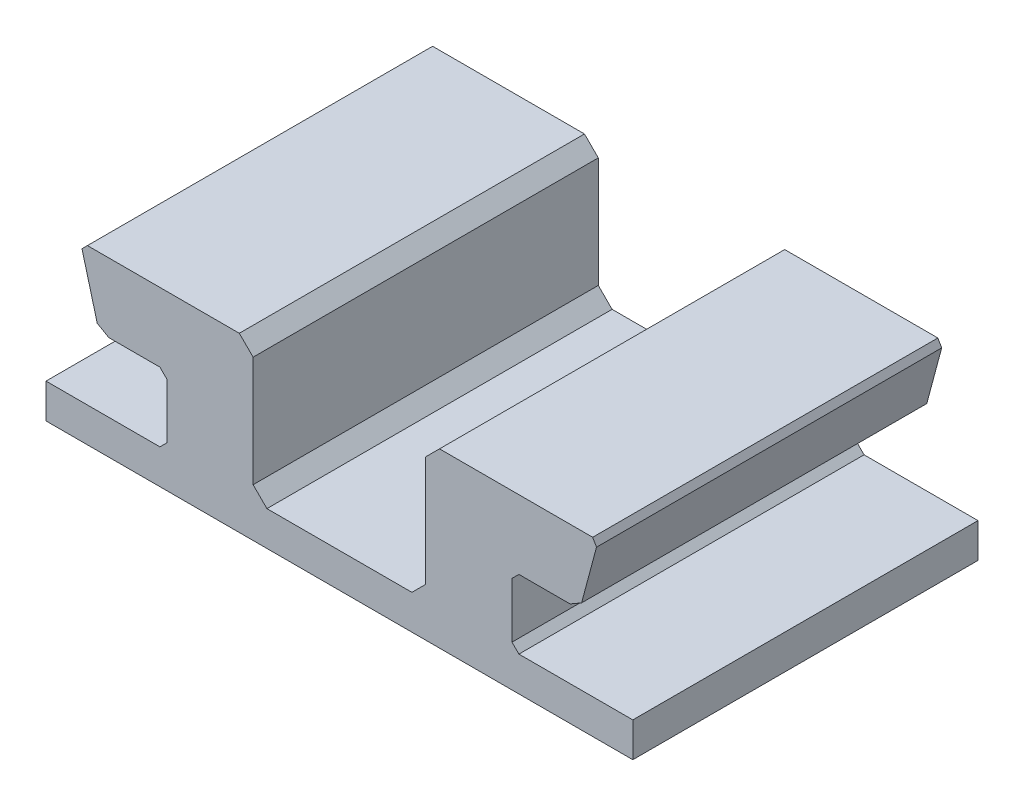
ISO-10303-21;
HEADER;
FILE_DESCRIPTION(('STEP AP214'),'2;1');
FILE_NAME('part.step','',(''),(''),'','','');
FILE_SCHEMA(('AUTOMOTIVE_DESIGN { 1 0 10303 214 1 1 1 1 }'));
ENDSEC;
DATA;
#1=APPLICATION_CONTEXT('core data for automotive mechanical design processes');
#2=APPLICATION_PROTOCOL_DEFINITION('international standard','automotive_design',2000,#1);
#3=PRODUCT_CONTEXT('',#1,'mechanical');
#4=PRODUCT('Part','Part','',(#3));
#5=PRODUCT_RELATED_PRODUCT_CATEGORY('part','',(#4));
#6=PRODUCT_DEFINITION_FORMATION('','',#4);
#7=PRODUCT_DEFINITION_CONTEXT('part definition',#1,'design');
#8=PRODUCT_DEFINITION('design','',#6,#7);
#9=PRODUCT_DEFINITION_SHAPE('','',#8);
#10=(LENGTH_UNIT() NAMED_UNIT(*) SI_UNIT(.MILLI.,.METRE.));
#11=(NAMED_UNIT(*) PLANE_ANGLE_UNIT() SI_UNIT($,.RADIAN.));
#12=(NAMED_UNIT(*) SI_UNIT($,.STERADIAN.) SOLID_ANGLE_UNIT());
#13=UNCERTAINTY_MEASURE_WITH_UNIT(LENGTH_MEASURE(1.E-05),#10,'distance_accuracy_value','');
#14=(GEOMETRIC_REPRESENTATION_CONTEXT(3) GLOBAL_UNCERTAINTY_ASSIGNED_CONTEXT((#13)) GLOBAL_UNIT_ASSIGNED_CONTEXT((#10,
#11,#12)) REPRESENTATION_CONTEXT('',''));
#15=CARTESIAN_POINT('',(0.,0.,0.));
#16=DIRECTION('',(0.,0.,1.));
#17=DIRECTION('',(1.,0.,0.));
#18=AXIS2_PLACEMENT_3D('',#15,#16,#17);
#19=CARTESIAN_POINT('',(50.,20.,50.));
#20=DIRECTION('',(1.,0.,0.));
#21=DIRECTION('',(0.,0.,-1.));
#22=AXIS2_PLACEMENT_3D('',#19,#20,#21);
#23=PLANE('',#22);
#24=DIRECTION('',(0.,-1.,0.));
#25=VECTOR('',#24,1.);
#26=CARTESIAN_POINT('',(50.,20.,50.));
#27=LINE('',#26,#25);
#28=CARTESIAN_POINT('',(50.,18.,50.));
#29=VERTEX_POINT('',#28);
#30=CARTESIAN_POINT('',(50.,1.99999999999999,50.));
#31=VERTEX_POINT('',#30);
#32=EDGE_CURVE('E302',#29,#31,#27,.T.);
#33=ORIENTED_EDGE('',*,*,#32,.F.);
#34=DIRECTION('',(0.,0.,-1.));
#35=VECTOR('',#34,1.);
#36=CARTESIAN_POINT('',(50.,18.,50.));
#37=LINE('',#36,#35);
#38=CARTESIAN_POINT('',(50.,18.,0.));
#39=VERTEX_POINT('',#38);
#40=EDGE_CURVE('E321',#29,#39,#37,.T.);
#41=ORIENTED_EDGE('',*,*,#40,.T.);
#42=DIRECTION('',(0.,-1.,0.));
#43=VECTOR('',#42,1.);
#44=CARTESIAN_POINT('',(50.,20.,0.));
#45=LINE('',#44,#43);
#46=CARTESIAN_POINT('',(50.,1.99999999999999,0.));
#47=VERTEX_POINT('',#46);
#48=EDGE_CURVE('E266',#39,#47,#45,.T.);
#49=ORIENTED_EDGE('',*,*,#48,.T.);
#50=DIRECTION('',(0.,0.,1.));
#51=VECTOR('',#50,1.);
#52=CARTESIAN_POINT('',(50.,1.99999999999999,50.));
#53=LINE('',#52,#51);
#54=EDGE_CURVE('E319',#47,#31,#53,.T.);
#55=ORIENTED_EDGE('',*,*,#54,.T.);
#56=EDGE_LOOP('',(#33,#41,#49,#55));
#57=FACE_BOUND('',#56,.T.);
#58=ADVANCED_FACE('F35',(#57),#23,.F.);
#59=CARTESIAN_POINT('',(25.,0.,50.));
#60=DIRECTION('',(0.,-1.,0.));
#61=DIRECTION('',(0.,0.,-1.));
#62=AXIS2_PLACEMENT_3D('',#59,#60,#61);
#63=PLANE('',#62);
#64=DIRECTION('',(-1.,0.,0.));
#65=VECTOR('',#64,1.);
#66=CARTESIAN_POINT('',(25.,0.,50.));
#67=LINE('',#66,#65);
#68=CARTESIAN_POINT('',(48.,0.,50.));
#69=VERTEX_POINT('',#68);
#70=CARTESIAN_POINT('',(27.,0.,50.));
#71=VERTEX_POINT('',#70);
#72=EDGE_CURVE('E447',#69,#71,#67,.T.);
#73=ORIENTED_EDGE('',*,*,#72,.F.);
#74=DIRECTION('',(0.,0.,-1.));
#75=VECTOR('',#74,1.);
#76=CARTESIAN_POINT('',(48.,0.,0.));
#77=LINE('',#76,#75);
#78=CARTESIAN_POINT('',(48.,0.,0.));
#79=VERTEX_POINT('',#78);
#80=EDGE_CURVE('E346',#69,#79,#77,.T.);
#81=ORIENTED_EDGE('',*,*,#80,.T.);
#82=DIRECTION('',(-1.,0.,0.));
#83=VECTOR('',#82,1.);
#84=CARTESIAN_POINT('',(25.,0.,0.));
#85=LINE('',#84,#83);
#86=CARTESIAN_POINT('',(27.,0.,0.));
#87=VERTEX_POINT('',#86);
#88=EDGE_CURVE('E269',#79,#87,#85,.T.);
#89=ORIENTED_EDGE('',*,*,#88,.T.);
#90=DIRECTION('',(0.,0.,1.));
#91=VECTOR('',#90,1.);
#92=CARTESIAN_POINT('',(27.,0.,50.));
#93=LINE('',#92,#91);
#94=EDGE_CURVE('E344',#87,#71,#93,.T.);
#95=ORIENTED_EDGE('',*,*,#94,.T.);
#96=EDGE_LOOP('',(#73,#81,#89,#95));
#97=FACE_BOUND('',#96,.T.);
#98=ADVANCED_FACE('F463',(#97),#63,.F.);
#99=CARTESIAN_POINT('',(25.,20.,50.));
#100=DIRECTION('',(-1.,0.,0.));
#101=DIRECTION('',(0.,0.,1.));
#102=AXIS2_PLACEMENT_3D('',#99,#100,#101);
#103=PLANE('',#102);
#104=DIRECTION('',(0.,1.,0.));
#105=VECTOR('',#104,1.);
#106=CARTESIAN_POINT('',(25.,20.,0.));
#107=LINE('',#106,#105);
#108=CARTESIAN_POINT('',(25.,2.00000000000002,0.));
#109=VERTEX_POINT('',#108);
#110=CARTESIAN_POINT('',(25.,18.,0.));
#111=VERTEX_POINT('',#110);
#112=EDGE_CURVE('E272',#109,#111,#107,.T.);
#113=ORIENTED_EDGE('',*,*,#112,.T.);
#114=DIRECTION('',(0.,0.,1.));
#115=VECTOR('',#114,1.);
#116=CARTESIAN_POINT('',(25.,18.,50.));
#117=LINE('',#116,#115);
#118=CARTESIAN_POINT('',(25.,18.,50.));
#119=VERTEX_POINT('',#118);
#120=EDGE_CURVE('E342',#111,#119,#117,.T.);
#121=ORIENTED_EDGE('',*,*,#120,.T.);
#122=DIRECTION('',(0.,1.,0.));
#123=VECTOR('',#122,1.);
#124=CARTESIAN_POINT('',(25.,20.,50.));
#125=LINE('',#124,#123);
#126=CARTESIAN_POINT('',(25.,2.00000000000002,50.));
#127=VERTEX_POINT('',#126);
#128=EDGE_CURVE('E444',#127,#119,#125,.T.);
#129=ORIENTED_EDGE('',*,*,#128,.F.);
#130=DIRECTION('',(0.,0.,-1.));
#131=VECTOR('',#130,1.);
#132=CARTESIAN_POINT('',(25.,2.00000000000002,0.));
#133=LINE('',#132,#131);
#134=EDGE_CURVE('E339',#127,#109,#133,.T.);
#135=ORIENTED_EDGE('',*,*,#134,.T.);
#136=EDGE_LOOP('',(#113,#121,#129,#135));
#137=FACE_BOUND('',#136,.T.);
#138=ADVANCED_FACE('F473',(#137),#103,.F.);
#139=CARTESIAN_POINT('',(0.,20.,50.));
#140=DIRECTION('',(0.,-1.,0.));
#141=DIRECTION('',(0.,0.,-1.));
#142=AXIS2_PLACEMENT_3D('',#139,#140,#141);
#143=PLANE('',#142);
#144=DIRECTION('',(-1.,0.,0.));
#145=VECTOR('',#144,1.);
#146=CARTESIAN_POINT('',(0.,20.,0.));
#147=LINE('',#146,#145);
#148=CARTESIAN_POINT('',(23.,20.,0.));
#149=VERTEX_POINT('',#148);
#150=CARTESIAN_POINT('',(1.00000000000003,20.,0.));
#151=VERTEX_POINT('',#150);
#152=EDGE_CURVE('E275',#149,#151,#147,.T.);
#153=ORIENTED_EDGE('',*,*,#152,.T.);
#154=DIRECTION('',(0.,0.,1.));
#155=VECTOR('',#154,1.);
#156=CARTESIAN_POINT('',(1.00000000000003,20.,50.));
#157=LINE('',#156,#155);
#158=CARTESIAN_POINT('',(1.00000000000003,20.,50.));
#159=VERTEX_POINT('',#158);
#160=EDGE_CURVE('E408',#151,#159,#157,.T.);
#161=ORIENTED_EDGE('',*,*,#160,.T.);
#162=DIRECTION('',(-1.,0.,0.));
#163=VECTOR('',#162,1.);
#164=CARTESIAN_POINT('',(0.,20.,50.));
#165=LINE('',#164,#163);
#166=CARTESIAN_POINT('',(23.,20.,50.));
#167=VERTEX_POINT('',#166);
#168=EDGE_CURVE('E439',#167,#159,#165,.T.);
#169=ORIENTED_EDGE('',*,*,#168,.F.);
#170=DIRECTION('',(0.,0.,-1.));
#171=VECTOR('',#170,1.);
#172=CARTESIAN_POINT('',(23.,20.,50.));
#173=LINE('',#172,#171);
#174=EDGE_CURVE('E336',#167,#149,#173,.T.);
#175=ORIENTED_EDGE('',*,*,#174,.T.);
#176=EDGE_LOOP('',(#153,#161,#169,#175));
#177=FACE_BOUND('',#176,.T.);
#178=ADVANCED_FACE('F482',(#177),#143,.F.);
#179=CARTESIAN_POINT('',(0.,10.,50.));
#180=DIRECTION('',(0.,1.,0.));
#181=DIRECTION('',(0.,0.,1.));
#182=AXIS2_PLACEMENT_3D('',#179,#180,#181);
#183=PLANE('',#182);
#184=DIRECTION('',(1.,0.,0.));
#185=VECTOR('',#184,1.);
#186=CARTESIAN_POINT('',(0.,10.,0.));
#187=LINE('',#186,#185);
#188=CARTESIAN_POINT('',(4.09370548668432,10.,0.));
#189=VERTEX_POINT('',#188);
#190=CARTESIAN_POINT('',(11.5,10.,0.));
#191=VERTEX_POINT('',#190);
#192=EDGE_CURVE('E278',#189,#191,#187,.T.);
#193=ORIENTED_EDGE('',*,*,#192,.T.);
#194=DIRECTION('',(0.,0.,1.));
#195=VECTOR('',#194,1.);
#196=CARTESIAN_POINT('',(11.5,10.,50.));
#197=LINE('',#196,#195);
#198=CARTESIAN_POINT('',(11.5,10.,50.));
#199=VERTEX_POINT('',#198);
#200=EDGE_CURVE('E401',#191,#199,#197,.T.);
#201=ORIENTED_EDGE('',*,*,#200,.T.);
#202=DIRECTION('',(1.,0.,0.));
#203=VECTOR('',#202,1.);
#204=CARTESIAN_POINT('',(0.,10.,50.));
#205=LINE('',#204,#203);
#206=CARTESIAN_POINT('',(4.09370548668432,10.,50.));
#207=VERTEX_POINT('',#206);
#208=EDGE_CURVE('E435',#207,#199,#205,.T.);
#209=ORIENTED_EDGE('',*,*,#208,.F.);
#210=DIRECTION('',(0.,0.,-1.));
#211=VECTOR('',#210,1.);
#212=CARTESIAN_POINT('',(4.09370548668432,10.,0.));
#213=LINE('',#212,#211);
#214=EDGE_CURVE('E398',#207,#189,#213,.T.);
#215=ORIENTED_EDGE('',*,*,#214,.T.);
#216=EDGE_LOOP('',(#193,#201,#209,#215));
#217=FACE_BOUND('',#216,.T.);
#218=ADVANCED_FACE('F428',(#217),#183,.F.);
#219=CARTESIAN_POINT('',(12.5,0.,50.));
#220=DIRECTION('',(1.,0.,0.));
#221=DIRECTION('',(0.,0.,-1.));
#222=AXIS2_PLACEMENT_3D('',#219,#220,#221);
#223=PLANE('',#222);
#224=DIRECTION('',(0.,-1.,0.));
#225=VECTOR('',#224,1.);
#226=CARTESIAN_POINT('',(12.5,0.,0.));
#227=LINE('',#226,#225);
#228=CARTESIAN_POINT('',(12.5,9.,0.));
#229=VERTEX_POINT('',#228);
#230=CARTESIAN_POINT('',(12.5,1.,0.));
#231=VERTEX_POINT('',#230);
#232=EDGE_CURVE('E281',#229,#231,#227,.T.);
#233=ORIENTED_EDGE('',*,*,#232,.T.);
#234=DIRECTION('',(0.,0.,1.));
#235=VECTOR('',#234,1.);
#236=CARTESIAN_POINT('',(12.5,1.,50.));
#237=LINE('',#236,#235);
#238=CARTESIAN_POINT('',(12.5,1.,50.));
#239=VERTEX_POINT('',#238);
#240=EDGE_CURVE('E396',#231,#239,#237,.T.);
#241=ORIENTED_EDGE('',*,*,#240,.T.);
#242=DIRECTION('',(0.,-1.,0.));
#243=VECTOR('',#242,1.);
#244=CARTESIAN_POINT('',(12.5,0.,50.));
#245=LINE('',#244,#243);
#246=CARTESIAN_POINT('',(12.5,9.,50.));
#247=VERTEX_POINT('',#246);
#248=EDGE_CURVE('E234',#247,#239,#245,.T.);
#249=ORIENTED_EDGE('',*,*,#248,.F.);
#250=DIRECTION('',(0.,0.,-1.));
#251=VECTOR('',#250,1.);
#252=CARTESIAN_POINT('',(12.5,9.,0.));
#253=LINE('',#252,#251);
#254=EDGE_CURVE('E393',#247,#229,#253,.T.);
#255=ORIENTED_EDGE('',*,*,#254,.T.);
#256=EDGE_LOOP('',(#233,#241,#249,#255));
#257=FACE_BOUND('',#256,.T.);
#258=ADVANCED_FACE('F437',(#257),#223,.F.);
#259=CARTESIAN_POINT('',(-5.,0.,50.));
#260=DIRECTION('',(0.,-1.,0.));
#261=DIRECTION('',(0.,0.,-1.));
#262=AXIS2_PLACEMENT_3D('',#259,#260,#261);
#263=PLANE('',#262);
#264=DIRECTION('',(-1.,0.,0.));
#265=VECTOR('',#264,1.);
#266=CARTESIAN_POINT('',(-5.,0.,50.));
#267=LINE('',#266,#265);
#268=CARTESIAN_POINT('',(11.5,0.,50.));
#269=VERTEX_POINT('',#268);
#270=CARTESIAN_POINT('',(-5.,0.,50.));
#271=VERTEX_POINT('',#270);
#272=EDGE_CURVE('E221',#269,#271,#267,.T.);
#273=ORIENTED_EDGE('',*,*,#272,.F.);
#274=DIRECTION('',(0.,0.,-1.));
#275=VECTOR('',#274,1.);
#276=CARTESIAN_POINT('',(11.5,0.,0.));
#277=LINE('',#276,#275);
#278=CARTESIAN_POINT('',(11.5,0.,0.));
#279=VERTEX_POINT('',#278);
#280=EDGE_CURVE('E391',#269,#279,#277,.T.);
#281=ORIENTED_EDGE('',*,*,#280,.T.);
#282=DIRECTION('',(-1.,0.,0.));
#283=VECTOR('',#282,1.);
#284=CARTESIAN_POINT('',(-5.,0.,0.));
#285=LINE('',#284,#283);
#286=CARTESIAN_POINT('',(-5.,0.,0.));
#287=VERTEX_POINT('',#286);
#288=EDGE_CURVE('E240',#279,#287,#285,.T.);
#289=ORIENTED_EDGE('',*,*,#288,.T.);
#290=DIRECTION('',(0.,0.,-1.));
#291=VECTOR('',#290,1.);
#292=CARTESIAN_POINT('',(-5.,0.,50.));
#293=LINE('',#292,#291);
#294=EDGE_CURVE('E237',#271,#287,#293,.T.);
#295=ORIENTED_EDGE('',*,*,#294,.F.);
#296=EDGE_LOOP('',(#273,#281,#289,#295));
#297=FACE_BOUND('',#296,.T.);
#298=ADVANCED_FACE('F238',(#297),#263,.F.);
#299=CARTESIAN_POINT('',(-5.,-5.,50.));
#300=DIRECTION('',(1.,0.,0.));
#301=DIRECTION('',(0.,0.,-1.));
#302=AXIS2_PLACEMENT_3D('',#299,#300,#301);
#303=PLANE('',#302);
#304=DIRECTION('',(0.,-1.,0.));
#305=VECTOR('',#304,1.);
#306=CARTESIAN_POINT('',(-5.,-5.,0.));
#307=LINE('',#306,#305);
#308=CARTESIAN_POINT('',(-5.,-5.,0.));
#309=VERTEX_POINT('',#308);
#310=EDGE_CURVE('E285',#287,#309,#307,.T.);
#311=ORIENTED_EDGE('',*,*,#310,.T.);
#312=DIRECTION('',(0.,0.,-1.));
#313=VECTOR('',#312,1.);
#314=CARTESIAN_POINT('',(-5.,-5.,50.));
#315=LINE('',#314,#313);
#316=CARTESIAN_POINT('',(-5.,-5.,50.));
#317=VERTEX_POINT('',#316);
#318=EDGE_CURVE('E244',#317,#309,#315,.T.);
#319=ORIENTED_EDGE('',*,*,#318,.F.);
#320=DIRECTION('',(0.,-1.,0.));
#321=VECTOR('',#320,1.);
#322=CARTESIAN_POINT('',(-5.,-5.,50.));
#323=LINE('',#322,#321);
#324=EDGE_CURVE('E226',#271,#317,#323,.T.);
#325=ORIENTED_EDGE('',*,*,#324,.F.);
#326=ORIENTED_EDGE('',*,*,#294,.T.);
#327=EDGE_LOOP('',(#311,#319,#325,#326));
#328=FACE_BOUND('',#327,.T.);
#329=ADVANCED_FACE('F246',(#328),#303,.F.);
#330=CARTESIAN_POINT('',(-5.,-5.,50.));
#331=DIRECTION('',(0.,1.,0.));
#332=DIRECTION('',(-1.,0.,0.));
#333=AXIS2_PLACEMENT_3D('',#330,#331,#332);
#334=PLANE('',#333);
#335=DIRECTION('',(1.,0.,0.));
#336=VECTOR('',#335,1.);
#337=CARTESIAN_POINT('',(-5.,-5.,0.));
#338=LINE('',#337,#336);
#339=CARTESIAN_POINT('',(80.,-4.99999999999998,0.));
#340=VERTEX_POINT('',#339);
#341=EDGE_CURVE('E287',#309,#340,#338,.T.);
#342=ORIENTED_EDGE('',*,*,#341,.T.);
#343=DIRECTION('',(0.,0.,-1.));
#344=VECTOR('',#343,1.);
#345=CARTESIAN_POINT('',(80.,-4.99999999999998,50.));
#346=LINE('',#345,#344);
#347=CARTESIAN_POINT('',(80.,-4.99999999999998,50.));
#348=VERTEX_POINT('',#347);
#349=EDGE_CURVE('E305',#348,#340,#346,.T.);
#350=ORIENTED_EDGE('',*,*,#349,.F.);
#351=DIRECTION('',(1.,0.,0.));
#352=VECTOR('',#351,1.);
#353=CARTESIAN_POINT('',(-5.,-5.,50.));
#354=LINE('',#353,#352);
#355=EDGE_CURVE('E249',#317,#348,#354,.T.);
#356=ORIENTED_EDGE('',*,*,#355,.F.);
#357=ORIENTED_EDGE('',*,*,#318,.T.);
#358=EDGE_LOOP('',(#342,#350,#356,#357));
#359=FACE_BOUND('',#358,.T.);
#360=ADVANCED_FACE('F589',(#359),#334,.F.);
#361=CARTESIAN_POINT('',(80.,-4.99999999999998,50.));
#362=DIRECTION('',(-1.,0.,0.));
#363=DIRECTION('',(0.,0.,1.));
#364=AXIS2_PLACEMENT_3D('',#361,#362,#363);
#365=PLANE('',#364);
#366=DIRECTION('',(0.,1.,0.));
#367=VECTOR('',#366,1.);
#368=CARTESIAN_POINT('',(80.,-4.99999999999998,0.));
#369=LINE('',#368,#367);
#370=CARTESIAN_POINT('',(80.,0.,0.));
#371=VERTEX_POINT('',#370);
#372=EDGE_CURVE('E289',#340,#371,#369,.T.);
#373=ORIENTED_EDGE('',*,*,#372,.T.);
#374=DIRECTION('',(0.,0.,-1.));
#375=VECTOR('',#374,1.);
#376=CARTESIAN_POINT('',(80.,0.,50.));
#377=LINE('',#376,#375);
#378=CARTESIAN_POINT('',(80.,0.,50.));
#379=VERTEX_POINT('',#378);
#380=EDGE_CURVE('E265',#379,#371,#377,.T.);
#381=ORIENTED_EDGE('',*,*,#380,.F.);
#382=DIRECTION('',(0.,1.,0.));
#383=VECTOR('',#382,1.);
#384=CARTESIAN_POINT('',(80.,-4.99999999999998,50.));
#385=LINE('',#384,#383);
#386=EDGE_CURVE('E251',#348,#379,#385,.T.);
#387=ORIENTED_EDGE('',*,*,#386,.F.);
#388=ORIENTED_EDGE('',*,*,#349,.T.);
#389=EDGE_LOOP('',(#373,#381,#387,#388));
#390=FACE_BOUND('',#389,.T.);
#391=ADVANCED_FACE('F596',(#390),#365,.F.);
#392=CARTESIAN_POINT('',(62.5,0.,50.));
#393=DIRECTION('',(0.,-1.,0.));
#394=DIRECTION('',(0.,0.,-1.));
#395=AXIS2_PLACEMENT_3D('',#392,#393,#394);
#396=PLANE('',#395);
#397=DIRECTION('',(-1.,0.,0.));
#398=VECTOR('',#397,1.);
#399=CARTESIAN_POINT('',(62.5,0.,0.));
#400=LINE('',#399,#398);
#401=CARTESIAN_POINT('',(63.5,0.,0.));
#402=VERTEX_POINT('',#401);
#403=EDGE_CURVE('E291',#371,#402,#400,.T.);
#404=ORIENTED_EDGE('',*,*,#403,.T.);
#405=DIRECTION('',(0.,0.,1.));
#406=VECTOR('',#405,1.);
#407=CARTESIAN_POINT('',(63.5,0.,50.));
#408=LINE('',#407,#406);
#409=CARTESIAN_POINT('',(63.5,0.,50.));
#410=VERTEX_POINT('',#409);
#411=EDGE_CURVE('E389',#402,#410,#408,.T.);
#412=ORIENTED_EDGE('',*,*,#411,.T.);
#413=DIRECTION('',(-1.,0.,0.));
#414=VECTOR('',#413,1.);
#415=CARTESIAN_POINT('',(62.5,0.,50.));
#416=LINE('',#415,#414);
#417=EDGE_CURVE('E256',#379,#410,#416,.T.);
#418=ORIENTED_EDGE('',*,*,#417,.F.);
#419=ORIENTED_EDGE('',*,*,#380,.T.);
#420=EDGE_LOOP('',(#404,#412,#418,#419));
#421=FACE_BOUND('',#420,.T.);
#422=ADVANCED_FACE('F599',(#421),#396,.F.);
#423=CARTESIAN_POINT('',(62.5,10.,50.));
#424=DIRECTION('',(-1.,0.,0.));
#425=DIRECTION('',(0.,0.,1.));
#426=AXIS2_PLACEMENT_3D('',#423,#424,#425);
#427=PLANE('',#426);
#428=DIRECTION('',(0.,1.,0.));
#429=VECTOR('',#428,1.);
#430=CARTESIAN_POINT('',(62.5,10.,0.));
#431=LINE('',#430,#429);
#432=CARTESIAN_POINT('',(62.5,1.00000000000001,0.));
#433=VERTEX_POINT('',#432);
#434=CARTESIAN_POINT('',(62.5,9.00000000000001,0.));
#435=VERTEX_POINT('',#434);
#436=EDGE_CURVE('E294',#433,#435,#431,.T.);
#437=ORIENTED_EDGE('',*,*,#436,.T.);
#438=DIRECTION('',(0.,0.,1.));
#439=VECTOR('',#438,1.);
#440=CARTESIAN_POINT('',(62.5,9.00000000000001,50.));
#441=LINE('',#440,#439);
#442=CARTESIAN_POINT('',(62.5,9.00000000000001,50.));
#443=VERTEX_POINT('',#442);
#444=EDGE_CURVE('E387',#435,#443,#441,.T.);
#445=ORIENTED_EDGE('',*,*,#444,.T.);
#446=DIRECTION('',(0.,1.,0.));
#447=VECTOR('',#446,1.);
#448=CARTESIAN_POINT('',(62.5,10.,50.));
#449=LINE('',#448,#447);
#450=CARTESIAN_POINT('',(62.5,1.00000000000001,50.));
#451=VERTEX_POINT('',#450);
#452=EDGE_CURVE('E259',#451,#443,#449,.T.);
#453=ORIENTED_EDGE('',*,*,#452,.F.);
#454=DIRECTION('',(0.,0.,-1.));
#455=VECTOR('',#454,1.);
#456=CARTESIAN_POINT('',(62.5,1.00000000000001,0.));
#457=LINE('',#456,#455);
#458=EDGE_CURVE('E384',#451,#433,#457,.T.);
#459=ORIENTED_EDGE('',*,*,#458,.T.);
#460=EDGE_LOOP('',(#437,#445,#453,#459));
#461=FACE_BOUND('',#460,.T.);
#462=ADVANCED_FACE('F604',(#461),#427,.F.);
#463=CARTESIAN_POINT('',(62.5,10.,50.));
#464=DIRECTION('',(0.,1.,0.));
#465=DIRECTION('',(0.,0.,1.));
#466=AXIS2_PLACEMENT_3D('',#463,#464,#465);
#467=PLANE('',#466);
#468=DIRECTION('',(1.,0.,0.));
#469=VECTOR('',#468,1.);
#470=CARTESIAN_POINT('',(62.5,10.,0.));
#471=LINE('',#470,#469);
#472=CARTESIAN_POINT('',(63.5,10.,0.));
#473=VERTEX_POINT('',#472);
#474=CARTESIAN_POINT('',(70.9062945133157,10.,0.));
#475=VERTEX_POINT('',#474);
#476=EDGE_CURVE('E297',#473,#475,#471,.T.);
#477=ORIENTED_EDGE('',*,*,#476,.T.);
#478=DIRECTION('',(0.,0.,1.));
#479=VECTOR('',#478,1.);
#480=CARTESIAN_POINT('',(70.9062945133157,10.,50.));
#481=LINE('',#480,#479);
#482=CARTESIAN_POINT('',(70.9062945133157,10.,50.));
#483=VERTEX_POINT('',#482);
#484=EDGE_CURVE('E382',#475,#483,#481,.T.);
#485=ORIENTED_EDGE('',*,*,#484,.T.);
#486=DIRECTION('',(1.,0.,0.));
#487=VECTOR('',#486,1.);
#488=CARTESIAN_POINT('',(62.5,10.,50.));
#489=LINE('',#488,#487);
#490=CARTESIAN_POINT('',(63.5,10.,50.));
#491=VERTEX_POINT('',#490);
#492=EDGE_CURVE('E261',#491,#483,#489,.T.);
#493=ORIENTED_EDGE('',*,*,#492,.F.);
#494=DIRECTION('',(0.,0.,-1.));
#495=VECTOR('',#494,1.);
#496=CARTESIAN_POINT('',(63.5,10.,0.));
#497=LINE('',#496,#495);
#498=EDGE_CURVE('E379',#491,#473,#497,.T.);
#499=ORIENTED_EDGE('',*,*,#498,.T.);
#500=EDGE_LOOP('',(#477,#485,#493,#499));
#501=FACE_BOUND('',#500,.T.);
#502=ADVANCED_FACE('F610',(#501),#467,.F.);
#503=CARTESIAN_POINT('',(50.,20.,50.));
#504=DIRECTION('',(0.,-1.,0.));
#505=DIRECTION('',(1.,0.,0.));
#506=AXIS2_PLACEMENT_3D('',#503,#504,#505);
#507=PLANE('',#506);
#508=DIRECTION('',(-1.,0.,0.));
#509=VECTOR('',#508,1.);
#510=CARTESIAN_POINT('',(50.,20.,50.));
#511=LINE('',#510,#509);
#512=CARTESIAN_POINT('',(74.1835034190723,20.,50.));
#513=VERTEX_POINT('',#512);
#514=CARTESIAN_POINT('',(52.,20.,50.));
#515=VERTEX_POINT('',#514);
#516=EDGE_CURVE('E263',#513,#515,#511,.T.);
#517=ORIENTED_EDGE('',*,*,#516,.F.);
#518=DIRECTION('',(0.,0.,-1.));
#519=VECTOR('',#518,1.);
#520=CARTESIAN_POINT('',(74.1835034190723,20.,0.));
#521=LINE('',#520,#519);
#522=CARTESIAN_POINT('',(74.1835034190723,20.,0.));
#523=VERTEX_POINT('',#522);
#524=EDGE_CURVE('E357',#513,#523,#521,.T.);
#525=ORIENTED_EDGE('',*,*,#524,.T.);
#526=DIRECTION('',(-1.,0.,0.));
#527=VECTOR('',#526,1.);
#528=CARTESIAN_POINT('',(50.,20.,0.));
#529=LINE('',#528,#527);
#530=CARTESIAN_POINT('',(52.,20.,0.));
#531=VERTEX_POINT('',#530);
#532=EDGE_CURVE('E300',#523,#531,#529,.T.);
#533=ORIENTED_EDGE('',*,*,#532,.T.);
#534=DIRECTION('',(0.,0.,1.));
#535=VECTOR('',#534,1.);
#536=CARTESIAN_POINT('',(52.,20.,50.));
#537=LINE('',#536,#535);
#538=EDGE_CURVE('E329',#531,#515,#537,.T.);
#539=ORIENTED_EDGE('',*,*,#538,.T.);
#540=EDGE_LOOP('',(#517,#525,#533,#539));
#541=FACE_BOUND('',#540,.T.);
#542=ADVANCED_FACE('F619',(#541),#507,.F.);
#543=CARTESIAN_POINT('',(0.,0.,50.));
#544=DIRECTION('',(0.,0.,1.));
#545=DIRECTION('',(1.,0.,0.));
#546=AXIS2_PLACEMENT_3D('',#543,#544,#545);
#547=PLANE('',#546);
#548=DIRECTION('',(-0.258819045102518,-0.965925826289069,0.));
#549=VECTOR('',#548,1.);
#550=CARTESIAN_POINT('',(64.9759526419166,-17.4102540378442,50.));
#551=LINE('',#550,#549);
#552=CARTESIAN_POINT('',(72.5793271207913,10.9659258262891,50.));
#553=VERTEX_POINT('',#552);
#554=CARTESIAN_POINT('',(74.7411809548975,19.034074173711,50.));
#555=VERTEX_POINT('',#554);
#556=EDGE_CURVE('E317',#553,#555,#551,.F.);
#557=ORIENTED_EDGE('',*,*,#556,.T.);
#558=DIRECTION('',(0.499999999999994,-0.866025403784442,0.));
#559=VECTOR('',#558,1.);
#560=CARTESIAN_POINT('',(64.297881602149,37.1223992513228,50.));
#561=LINE('',#560,#559);
#562=EDGE_CURVE('E377',#555,#513,#561,.F.);
#563=ORIENTED_EDGE('',*,*,#562,.T.);
#564=ORIENTED_EDGE('',*,*,#516,.T.);
#565=DIRECTION('',(0.70710678118655,0.707106781186545,0.));
#566=VECTOR('',#565,1.);
#567=CARTESIAN_POINT('',(15.9999999999998,-15.9999999999999,50.));
#568=LINE('',#567,#566);
#569=EDGE_CURVE('E334',#515,#29,#568,.F.);
#570=ORIENTED_EDGE('',*,*,#569,.T.);
#571=ORIENTED_EDGE('',*,*,#32,.T.);
#572=DIRECTION('',(0.707106781186552,0.707106781186543,0.));
#573=VECTOR('',#572,1.);
#574=CARTESIAN_POINT('',(48.,0.,50.));
#575=LINE('',#574,#573);
#576=EDGE_CURVE('E351',#31,#69,#575,.F.);
#577=ORIENTED_EDGE('',*,*,#576,.T.);
#578=ORIENTED_EDGE('',*,*,#72,.T.);
#579=DIRECTION('',(0.707106781186543,-0.707106781186552,0.));
#580=VECTOR('',#579,1.);
#581=CARTESIAN_POINT('',(25.,2.00000000000002,50.));
#582=LINE('',#581,#580);
#583=EDGE_CURVE('E355',#71,#127,#582,.F.);
#584=ORIENTED_EDGE('',*,*,#583,.T.);
#585=ORIENTED_EDGE('',*,*,#128,.T.);
#586=DIRECTION('',(0.707106781186545,-0.70710678118655,0.));
#587=VECTOR('',#586,1.);
#588=CARTESIAN_POINT('',(21.5000000000001,21.4999999999999,50.));
#589=LINE('',#588,#587);
#590=EDGE_CURVE('E332',#119,#167,#589,.F.);
#591=ORIENTED_EDGE('',*,*,#590,.T.);
#592=ORIENTED_EDGE('',*,*,#168,.T.);
#593=DIRECTION('',(0.707106781186546,0.707106781186549,0.));
#594=VECTOR('',#593,1.);
#595=CARTESIAN_POINT('',(-9.49999999999998,9.49999999999994,50.));
#596=LINE('',#595,#594);
#597=CARTESIAN_POINT('',(0.211324865405224,19.2113248654052,50.));
#598=VERTEX_POINT('',#597);
#599=EDGE_CURVE('E372',#159,#598,#596,.F.);
#600=ORIENTED_EDGE('',*,*,#599,.T.);
#601=DIRECTION('',(-0.258819045102518,0.965925826289069,0.));
#602=VECTOR('',#601,1.);
#603=CARTESIAN_POINT('',(4.99999999999999,1.33974596215559,50.));
#604=LINE('',#603,#602);
#605=CARTESIAN_POINT('',(2.42067287920872,10.9659258262891,50.));
#606=VERTEX_POINT('',#605);
#607=EDGE_CURVE('E314',#598,#606,#604,.F.);
#608=ORIENTED_EDGE('',*,*,#607,.T.);
#609=DIRECTION('',(-0.866025403784436,0.500000000000004,0.));
#610=VECTOR('',#609,1.);
#611=CARTESIAN_POINT('',(5.35355339059331,9.27262647354015,50.));
#612=LINE('',#611,#610);
#613=EDGE_CURVE('E374',#606,#207,#612,.F.);
#614=ORIENTED_EDGE('',*,*,#613,.T.);
#615=ORIENTED_EDGE('',*,*,#208,.T.);
#616=DIRECTION('',(-0.707106781186543,0.707106781186552,0.));
#617=VECTOR('',#616,1.);
#618=CARTESIAN_POINT('',(12.5,9.,50.));
#619=LINE('',#618,#617);
#620=EDGE_CURVE('E11',#199,#247,#619,.F.);
#621=ORIENTED_EDGE('',*,*,#620,.T.);
#622=ORIENTED_EDGE('',*,*,#248,.T.);
#623=DIRECTION('',(0.707106781186553,0.707106781186542,0.));
#624=VECTOR('',#623,1.);
#625=CARTESIAN_POINT('',(11.5,0.,50.));
#626=LINE('',#625,#624);
#627=EDGE_CURVE('E230',#239,#269,#626,.F.);
#628=ORIENTED_EDGE('',*,*,#627,.T.);
#629=ORIENTED_EDGE('',*,*,#272,.T.);
#630=ORIENTED_EDGE('',*,*,#324,.T.);
#631=ORIENTED_EDGE('',*,*,#355,.T.);
#632=ORIENTED_EDGE('',*,*,#386,.T.);
#633=ORIENTED_EDGE('',*,*,#417,.T.);
#634=DIRECTION('',(0.707106781186543,-0.707106781186552,0.));
#635=VECTOR('',#634,1.);
#636=CARTESIAN_POINT('',(62.5,1.00000000000001,50.));
#637=LINE('',#636,#635);
#638=EDGE_CURVE('E415',#410,#451,#637,.F.);
#639=ORIENTED_EDGE('',*,*,#638,.T.);
#640=ORIENTED_EDGE('',*,*,#452,.T.);
#641=DIRECTION('',(-0.707106781186548,-0.707106781186548,0.));
#642=VECTOR('',#641,1.);
#643=CARTESIAN_POINT('',(63.5,10.,50.));
#644=LINE('',#643,#642);
#645=EDGE_CURVE('E59',#443,#491,#644,.F.);
#646=ORIENTED_EDGE('',*,*,#645,.T.);
#647=ORIENTED_EDGE('',*,*,#492,.T.);
#648=DIRECTION('',(-0.866025403784435,-0.500000000000007,0.));
#649=VECTOR('',#648,1.);
#650=CARTESIAN_POINT('',(13.3964466094072,-23.2033261683766,50.));
#651=LINE('',#650,#649);
#652=EDGE_CURVE('E51',#483,#553,#651,.F.);
#653=ORIENTED_EDGE('',*,*,#652,.T.);
#654=EDGE_LOOP('',(#557,#563,#564,#570,#571,#577,#578,#584,#585,#591,#592,#600,#608,#614,#615,
#621,#622,#628,#629,#630,#631,#632,#633,#639,#640,#646,#647,#653));
#655=FACE_BOUND('',#654,.T.);
#656=ADVANCED_FACE('F224',(#655),#547,.T.);
#657=CARTESIAN_POINT('',(0.,0.,0.));
#658=DIRECTION('',(0.,0.,1.));
#659=DIRECTION('',(1.,0.,0.));
#660=AXIS2_PLACEMENT_3D('',#657,#658,#659);
#661=PLANE('',#660);
#662=ORIENTED_EDGE('',*,*,#532,.F.);
#663=DIRECTION('',(-0.499999999999994,0.866025403784442,0.));
#664=VECTOR('',#663,1.);
#665=CARTESIAN_POINT('',(74.1835034190723,20.,0.));
#666=LINE('',#665,#664);
#667=CARTESIAN_POINT('',(74.7411809548974,19.0340741737109,0.));
#668=VERTEX_POINT('',#667);
#669=EDGE_CURVE('E366',#523,#668,#666,.F.);
#670=ORIENTED_EDGE('',*,*,#669,.T.);
#671=DIRECTION('',(0.258819045102518,0.965925826289069,0.));
#672=VECTOR('',#671,1.);
#673=CARTESIAN_POINT('',(75.,20.0000000000001,0.));
#674=LINE('',#673,#672);
#675=CARTESIAN_POINT('',(72.5793271207913,10.9659258262891,0.));
#676=VERTEX_POINT('',#675);
#677=EDGE_CURVE('E311',#668,#676,#674,.F.);
#678=ORIENTED_EDGE('',*,*,#677,.T.);
#679=DIRECTION('',(0.866025403784435,0.500000000000007,0.));
#680=VECTOR('',#679,1.);
#681=CARTESIAN_POINT('',(70.9062945133157,10.,0.));
#682=LINE('',#681,#680);
#683=EDGE_CURVE('E364',#676,#475,#682,.F.);
#684=ORIENTED_EDGE('',*,*,#683,.T.);
#685=ORIENTED_EDGE('',*,*,#476,.F.);
#686=DIRECTION('',(0.707106781186548,0.707106781186548,0.));
#687=VECTOR('',#686,1.);
#688=CARTESIAN_POINT('',(26.75,-26.75,0.));
#689=LINE('',#688,#687);
#690=EDGE_CURVE('E410',#473,#435,#689,.F.);
#691=ORIENTED_EDGE('',*,*,#690,.T.);
#692=ORIENTED_EDGE('',*,*,#436,.F.);
#693=DIRECTION('',(-0.707106781186543,0.707106781186552,0.));
#694=VECTOR('',#693,1.);
#695=CARTESIAN_POINT('',(31.7500000000004,31.75,0.));
#696=LINE('',#695,#694);
#697=EDGE_CURVE('E413',#433,#402,#696,.F.);
#698=ORIENTED_EDGE('',*,*,#697,.T.);
#699=ORIENTED_EDGE('',*,*,#403,.F.);
#700=ORIENTED_EDGE('',*,*,#372,.F.);
#701=ORIENTED_EDGE('',*,*,#341,.F.);
#702=ORIENTED_EDGE('',*,*,#310,.F.);
#703=ORIENTED_EDGE('',*,*,#288,.F.);
#704=DIRECTION('',(-0.707106781186553,-0.707106781186542,0.));
#705=VECTOR('',#704,1.);
#706=CARTESIAN_POINT('',(5.7499999999999,-5.74999999999999,0.));
#707=LINE('',#706,#705);
#708=EDGE_CURVE('E417',#279,#231,#707,.F.);
#709=ORIENTED_EDGE('',*,*,#708,.T.);
#710=ORIENTED_EDGE('',*,*,#232,.F.);
#711=DIRECTION('',(0.707106781186543,-0.707106781186552,0.));
#712=VECTOR('',#711,1.);
#713=CARTESIAN_POINT('',(10.7500000000001,10.7499999999999,0.));
#714=LINE('',#713,#712);
#715=EDGE_CURVE('E44',#229,#191,#714,.F.);
#716=ORIENTED_EDGE('',*,*,#715,.T.);
#717=ORIENTED_EDGE('',*,*,#192,.F.);
#718=DIRECTION('',(0.866025403784436,-0.500000000000004,0.));
#719=VECTOR('',#718,1.);
#720=CARTESIAN_POINT('',(4.09370548668432,10.,0.));
#721=LINE('',#720,#719);
#722=CARTESIAN_POINT('',(2.42067287920872,10.9659258262891,0.));
#723=VERTEX_POINT('',#722);
#724=EDGE_CURVE('E362',#189,#723,#721,.F.);
#725=ORIENTED_EDGE('',*,*,#724,.T.);
#726=DIRECTION('',(0.258819045102518,-0.965925826289069,0.));
#727=VECTOR('',#726,1.);
#728=CARTESIAN_POINT('',(2.67949192431123,10.,0.));
#729=LINE('',#728,#727);
#730=CARTESIAN_POINT('',(0.211324865405223,19.2113248654052,0.));
#731=VERTEX_POINT('',#730);
#732=EDGE_CURVE('E243',#723,#731,#729,.F.);
#733=ORIENTED_EDGE('',*,*,#732,.T.);
#734=DIRECTION('',(-0.707106781186546,-0.707106781186549,0.));
#735=VECTOR('',#734,1.);
#736=CARTESIAN_POINT('',(0.211324865405222,19.2113248654052,0.));
#737=LINE('',#736,#735);
#738=EDGE_CURVE('E360',#731,#151,#737,.F.);
#739=ORIENTED_EDGE('',*,*,#738,.T.);
#740=ORIENTED_EDGE('',*,*,#152,.F.);
#741=DIRECTION('',(-0.707106781186545,0.70710678118655,0.));
#742=VECTOR('',#741,1.);
#743=CARTESIAN_POINT('',(23.,20.,0.));
#744=LINE('',#743,#742);
#745=EDGE_CURVE('E324',#149,#111,#744,.F.);
#746=ORIENTED_EDGE('',*,*,#745,.T.);
#747=ORIENTED_EDGE('',*,*,#112,.F.);
#748=DIRECTION('',(-0.707106781186543,0.707106781186552,0.));
#749=VECTOR('',#748,1.);
#750=CARTESIAN_POINT('',(13.5000000000002,13.5,0.));
#751=LINE('',#750,#749);
#752=EDGE_CURVE('E353',#109,#87,#751,.F.);
#753=ORIENTED_EDGE('',*,*,#752,.T.);
#754=ORIENTED_EDGE('',*,*,#88,.F.);
#755=DIRECTION('',(-0.707106781186552,-0.707106781186543,0.));
#756=VECTOR('',#755,1.);
#757=CARTESIAN_POINT('',(23.9999999999997,-24.,0.));
#758=LINE('',#757,#756);
#759=EDGE_CURVE('E349',#79,#47,#758,.F.);
#760=ORIENTED_EDGE('',*,*,#759,.T.);
#761=ORIENTED_EDGE('',*,*,#48,.F.);
#762=DIRECTION('',(-0.70710678118655,-0.707106781186545,0.));
#763=VECTOR('',#762,1.);
#764=CARTESIAN_POINT('',(50.,18.,0.));
#765=LINE('',#764,#763);
#766=EDGE_CURVE('E326',#39,#531,#765,.F.);
#767=ORIENTED_EDGE('',*,*,#766,.T.);
#768=EDGE_LOOP('',(#662,#670,#678,#684,#685,#691,#692,#698,#699,#700,#701,#702,#703,#709,#710,
#716,#717,#725,#733,#739,#740,#746,#747,#753,#754,#760,#761,#767));
#769=FACE_BOUND('',#768,.T.);
#770=ADVANCED_FACE('F423',(#769),#661,.F.);
#771=CARTESIAN_POINT('',(75.,20.0000000000001,50.));
#772=DIRECTION('',(-0.965925826289069,0.258819045102518,0.));
#773=DIRECTION('',(0.,0.,-1.));
#774=AXIS2_PLACEMENT_3D('',#771,#772,#773);
#775=PLANE('',#774);
#776=ORIENTED_EDGE('',*,*,#677,.F.);
#777=DIRECTION('',(0.,0.,-1.));
#778=VECTOR('',#777,1.);
#779=CARTESIAN_POINT('',(74.7411809548974,19.0340741737109,50.));
#780=LINE('',#779,#778);
#781=EDGE_CURVE('E370',#668,#555,#780,.F.);
#782=ORIENTED_EDGE('',*,*,#781,.T.);
#783=ORIENTED_EDGE('',*,*,#556,.F.);
#784=DIRECTION('',(0.,0.,1.));
#785=VECTOR('',#784,1.);
#786=CARTESIAN_POINT('',(72.5793271207913,10.9659258262891,0.));
#787=LINE('',#786,#785);
#788=EDGE_CURVE('E368',#553,#676,#787,.F.);
#789=ORIENTED_EDGE('',*,*,#788,.T.);
#790=EDGE_LOOP('',(#776,#782,#783,#789));
#791=FACE_BOUND('',#790,.T.);
#792=ADVANCED_FACE('F512',(#791),#775,.F.);
#793=CARTESIAN_POINT('',(2.67949192431123,10.,50.));
#794=DIRECTION('',(0.965925826289069,0.258819045102518,0.));
#795=DIRECTION('',(0.,0.,-1.));
#796=AXIS2_PLACEMENT_3D('',#793,#794,#795);
#797=PLANE('',#796);
#798=ORIENTED_EDGE('',*,*,#732,.F.);
#799=DIRECTION('',(0.,0.,-1.));
#800=VECTOR('',#799,1.);
#801=CARTESIAN_POINT('',(2.42067287920872,10.9659258262891,50.));
#802=LINE('',#801,#800);
#803=EDGE_CURVE('E406',#723,#606,#802,.F.);
#804=ORIENTED_EDGE('',*,*,#803,.T.);
#805=ORIENTED_EDGE('',*,*,#607,.F.);
#806=DIRECTION('',(0.,0.,1.));
#807=VECTOR('',#806,1.);
#808=CARTESIAN_POINT('',(0.211324865405223,19.2113248654052,0.));
#809=LINE('',#808,#807);
#810=EDGE_CURVE('E403',#598,#731,#809,.F.);
#811=ORIENTED_EDGE('',*,*,#810,.T.);
#812=EDGE_LOOP('',(#798,#804,#805,#811));
#813=FACE_BOUND('',#812,.T.);
#814=ADVANCED_FACE('F490',(#813),#797,.F.);
#815=CARTESIAN_POINT('',(50.,18.,50.));
#816=DIRECTION('',(0.707106781186545,-0.70710678118655,0.));
#817=DIRECTION('',(0.,0.,-1.));
#818=AXIS2_PLACEMENT_3D('',#815,#816,#817);
#819=PLANE('',#818);
#820=ORIENTED_EDGE('',*,*,#569,.F.);
#821=ORIENTED_EDGE('',*,*,#538,.F.);
#822=ORIENTED_EDGE('',*,*,#766,.F.);
#823=ORIENTED_EDGE('',*,*,#40,.F.);
#824=EDGE_LOOP('',(#820,#821,#822,#823));
#825=FACE_BOUND('',#824,.T.);
#826=ADVANCED_FACE('F524',(#825),#819,.F.);
#827=CARTESIAN_POINT('',(23.,20.,50.));
#828=DIRECTION('',(-0.70710678118655,-0.707106781186545,0.));
#829=DIRECTION('',(0.,0.,-1.));
#830=AXIS2_PLACEMENT_3D('',#827,#828,#829);
#831=PLANE('',#830);
#832=ORIENTED_EDGE('',*,*,#590,.F.);
#833=ORIENTED_EDGE('',*,*,#120,.F.);
#834=ORIENTED_EDGE('',*,*,#745,.F.);
#835=ORIENTED_EDGE('',*,*,#174,.F.);
#836=EDGE_LOOP('',(#832,#833,#834,#835));
#837=FACE_BOUND('',#836,.T.);
#838=ADVANCED_FACE('F479',(#837),#831,.F.);
#839=CARTESIAN_POINT('',(48.,0.,50.));
#840=DIRECTION('',(-0.707106781186543,0.707106781186552,0.));
#841=DIRECTION('',(0.,0.,1.));
#842=AXIS2_PLACEMENT_3D('',#839,#840,#841);
#843=PLANE('',#842);
#844=ORIENTED_EDGE('',*,*,#576,.F.);
#845=ORIENTED_EDGE('',*,*,#54,.F.);
#846=ORIENTED_EDGE('',*,*,#759,.F.);
#847=ORIENTED_EDGE('',*,*,#80,.F.);
#848=EDGE_LOOP('',(#844,#845,#846,#847));
#849=FACE_BOUND('',#848,.T.);
#850=ADVANCED_FACE('F460',(#849),#843,.T.);
#851=CARTESIAN_POINT('',(25.,2.00000000000002,50.));
#852=DIRECTION('',(0.707106781186552,0.707106781186543,0.));
#853=DIRECTION('',(0.,0.,1.));
#854=AXIS2_PLACEMENT_3D('',#851,#852,#853);
#855=PLANE('',#854);
#856=ORIENTED_EDGE('',*,*,#583,.F.);
#857=ORIENTED_EDGE('',*,*,#94,.F.);
#858=ORIENTED_EDGE('',*,*,#752,.F.);
#859=ORIENTED_EDGE('',*,*,#134,.F.);
#860=EDGE_LOOP('',(#856,#857,#858,#859));
#861=FACE_BOUND('',#860,.T.);
#862=ADVANCED_FACE('F470',(#861),#855,.T.);
#863=CARTESIAN_POINT('',(74.1835034190723,20.,50.));
#864=DIRECTION('',(-0.866025403784442,-0.499999999999994,0.));
#865=DIRECTION('',(0.,0.,-1.));
#866=AXIS2_PLACEMENT_3D('',#863,#864,#865);
#867=PLANE('',#866);
#868=ORIENTED_EDGE('',*,*,#562,.F.);
#869=ORIENTED_EDGE('',*,*,#781,.F.);
#870=ORIENTED_EDGE('',*,*,#669,.F.);
#871=ORIENTED_EDGE('',*,*,#524,.F.);
#872=EDGE_LOOP('',(#868,#869,#870,#871));
#873=FACE_BOUND('',#872,.T.);
#874=ADVANCED_FACE('F546',(#873),#867,.F.);
#875=CARTESIAN_POINT('',(70.9062945133157,10.,50.));
#876=DIRECTION('',(-0.500000000000007,0.866025403784434,0.));
#877=DIRECTION('',(0.,0.,1.));
#878=AXIS2_PLACEMENT_3D('',#875,#876,#877);
#879=PLANE('',#878);
#880=ORIENTED_EDGE('',*,*,#683,.F.);
#881=ORIENTED_EDGE('',*,*,#788,.F.);
#882=ORIENTED_EDGE('',*,*,#652,.F.);
#883=ORIENTED_EDGE('',*,*,#484,.F.);
#884=EDGE_LOOP('',(#880,#881,#882,#883));
#885=FACE_BOUND('',#884,.T.);
#886=ADVANCED_FACE('F552',(#885),#879,.F.);
#887=CARTESIAN_POINT('',(63.5,10.,50.));
#888=DIRECTION('',(0.707106781186547,-0.707106781186547,0.));
#889=DIRECTION('',(0.,0.,1.));
#890=AXIS2_PLACEMENT_3D('',#887,#888,#889);
#891=PLANE('',#890);
#892=ORIENTED_EDGE('',*,*,#645,.F.);
#893=ORIENTED_EDGE('',*,*,#444,.F.);
#894=ORIENTED_EDGE('',*,*,#690,.F.);
#895=ORIENTED_EDGE('',*,*,#498,.F.);
#896=EDGE_LOOP('',(#892,#893,#894,#895));
#897=FACE_BOUND('',#896,.T.);
#898=ADVANCED_FACE('F559',(#897),#891,.T.);
#899=CARTESIAN_POINT('',(62.5,1.00000000000001,50.));
#900=DIRECTION('',(0.707106781186552,0.707106781186542,0.));
#901=DIRECTION('',(0.,0.,1.));
#902=AXIS2_PLACEMENT_3D('',#899,#900,#901);
#903=PLANE('',#902);
#904=ORIENTED_EDGE('',*,*,#638,.F.);
#905=ORIENTED_EDGE('',*,*,#411,.F.);
#906=ORIENTED_EDGE('',*,*,#697,.F.);
#907=ORIENTED_EDGE('',*,*,#458,.F.);
#908=EDGE_LOOP('',(#904,#905,#906,#907));
#909=FACE_BOUND('',#908,.T.);
#910=ADVANCED_FACE('F565',(#909),#903,.T.);
#911=CARTESIAN_POINT('',(11.5,0.,50.));
#912=DIRECTION('',(-0.707106781186542,0.707106781186553,0.));
#913=DIRECTION('',(0.,0.,1.));
#914=AXIS2_PLACEMENT_3D('',#911,#912,#913);
#915=PLANE('',#914);
#916=ORIENTED_EDGE('',*,*,#627,.F.);
#917=ORIENTED_EDGE('',*,*,#240,.F.);
#918=ORIENTED_EDGE('',*,*,#708,.F.);
#919=ORIENTED_EDGE('',*,*,#280,.F.);
#920=EDGE_LOOP('',(#916,#917,#918,#919));
#921=FACE_BOUND('',#920,.T.);
#922=ADVANCED_FACE('F500',(#921),#915,.T.);
#923=CARTESIAN_POINT('',(12.5,9.,50.));
#924=DIRECTION('',(-0.707106781186552,-0.707106781186543,0.));
#925=DIRECTION('',(0.,0.,1.));
#926=AXIS2_PLACEMENT_3D('',#923,#924,#925);
#927=PLANE('',#926);
#928=ORIENTED_EDGE('',*,*,#620,.F.);
#929=ORIENTED_EDGE('',*,*,#200,.F.);
#930=ORIENTED_EDGE('',*,*,#715,.F.);
#931=ORIENTED_EDGE('',*,*,#254,.F.);
#932=EDGE_LOOP('',(#928,#929,#930,#931));
#933=FACE_BOUND('',#932,.T.);
#934=ADVANCED_FACE('F433',(#933),#927,.T.);
#935=CARTESIAN_POINT('',(4.09370548668432,10.,50.));
#936=DIRECTION('',(0.500000000000004,0.866025403784436,0.));
#937=DIRECTION('',(0.,0.,-1.));
#938=AXIS2_PLACEMENT_3D('',#935,#936,#937);
#939=PLANE('',#938);
#940=ORIENTED_EDGE('',*,*,#613,.F.);
#941=ORIENTED_EDGE('',*,*,#803,.F.);
#942=ORIENTED_EDGE('',*,*,#724,.F.);
#943=ORIENTED_EDGE('',*,*,#214,.F.);
#944=EDGE_LOOP('',(#940,#941,#942,#943));
#945=FACE_BOUND('',#944,.T.);
#946=ADVANCED_FACE('F494',(#945),#939,.F.);
#947=CARTESIAN_POINT('',(0.211324865405222,19.2113248654052,50.));
#948=DIRECTION('',(0.707106781186549,-0.707106781186546,0.));
#949=DIRECTION('',(0.,0.,-1.));
#950=AXIS2_PLACEMENT_3D('',#947,#948,#949);
#951=PLANE('',#950);
#952=ORIENTED_EDGE('',*,*,#599,.F.);
#953=ORIENTED_EDGE('',*,*,#160,.F.);
#954=ORIENTED_EDGE('',*,*,#738,.F.);
#955=ORIENTED_EDGE('',*,*,#810,.F.);
#956=EDGE_LOOP('',(#952,#953,#954,#955));
#957=FACE_BOUND('',#956,.T.);
#958=ADVANCED_FACE('F38',(#957),#951,.F.);
#959=CLOSED_SHELL('',(#58,#98,#138,#178,#218,#258,#298,#329,#360,#391,#422,#462,#502,#542,#656,
#770,#792,#814,#826,#838,#850,#862,#874,#886,#898,#910,#922,#934,#946,#958));
#960=MANIFOLD_SOLID_BREP('B2',#959);
#961=ADVANCED_BREP_SHAPE_REPRESENTATION('',(#18,#960),#14);
#962=SHAPE_DEFINITION_REPRESENTATION(#9,#961);
ENDSEC;
END-ISO-10303-21;
